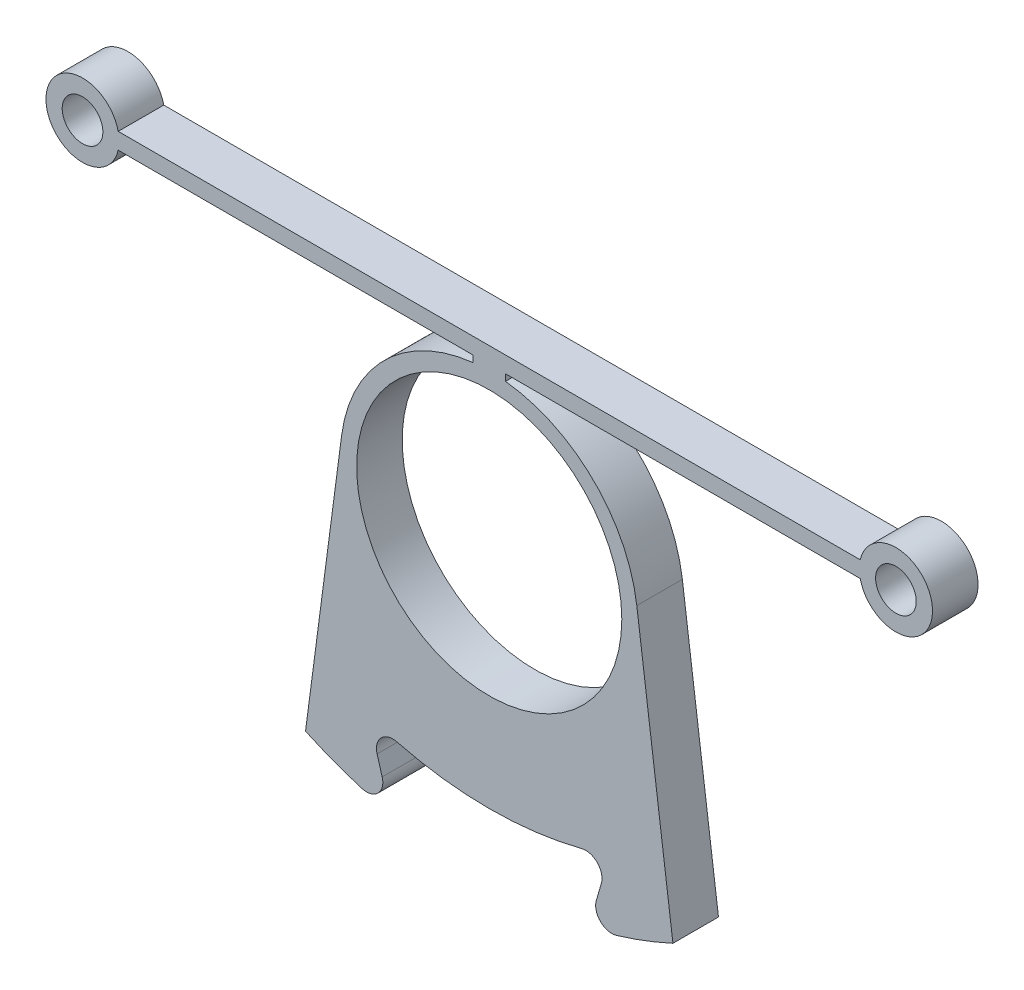
ISO-10303-21;
HEADER;
FILE_DESCRIPTION(('STEP AP214'),'2;1');
FILE_NAME('part.step','',(''),(''),'','','');
FILE_SCHEMA(('AUTOMOTIVE_DESIGN { 1 0 10303 214 1 1 1 1 }'));
ENDSEC;
DATA;
#1=APPLICATION_CONTEXT('core data for automotive mechanical design processes');
#2=APPLICATION_PROTOCOL_DEFINITION('international standard','automotive_design',2000,#1);
#3=PRODUCT_CONTEXT('',#1,'mechanical');
#4=PRODUCT('Part','Part','',(#3));
#5=PRODUCT_RELATED_PRODUCT_CATEGORY('part','',(#4));
#6=PRODUCT_DEFINITION_FORMATION('','',#4);
#7=PRODUCT_DEFINITION_CONTEXT('part definition',#1,'design');
#8=PRODUCT_DEFINITION('design','',#6,#7);
#9=PRODUCT_DEFINITION_SHAPE('','',#8);
#10=(LENGTH_UNIT() NAMED_UNIT(*) SI_UNIT(.MILLI.,.METRE.));
#11=(NAMED_UNIT(*) PLANE_ANGLE_UNIT() SI_UNIT($,.RADIAN.));
#12=(NAMED_UNIT(*) SI_UNIT($,.STERADIAN.) SOLID_ANGLE_UNIT());
#13=UNCERTAINTY_MEASURE_WITH_UNIT(LENGTH_MEASURE(1.E-05),#10,'distance_accuracy_value','');
#14=(GEOMETRIC_REPRESENTATION_CONTEXT(3) GLOBAL_UNCERTAINTY_ASSIGNED_CONTEXT((#13)) GLOBAL_UNIT_ASSIGNED_CONTEXT((#10,
#11,#12)) REPRESENTATION_CONTEXT('',''));
#15=CARTESIAN_POINT('',(0.,0.,0.));
#16=DIRECTION('',(0.,0.,1.));
#17=DIRECTION('',(1.,0.,0.));
#18=AXIS2_PLACEMENT_3D('',#15,#16,#17);
#19=CARTESIAN_POINT('',(0.,-5.,2.8));
#20=DIRECTION('',(0.,0.,-1.));
#21=DIRECTION('',(-1.,0.,0.));
#22=AXIS2_PLACEMENT_3D('',#19,#20,#21);
#23=CYLINDRICAL_SURFACE('',#22,9.15);
#24=CARTESIAN_POINT('',(0.,-5.,0.));
#25=DIRECTION('',(0.,0.,1.));
#26=DIRECTION('',(1.,0.,0.));
#27=AXIS2_PLACEMENT_3D('',#24,#25,#26);
#28=CIRCLE('',#27,9.15);
#29=CARTESIAN_POINT('',(9.07172048157037,-3.80568534118655,0.));
#30=VERTEX_POINT('',#29);
#31=CARTESIAN_POINT('',(1.,4.09519103702611,0.));
#32=VERTEX_POINT('',#31);
#33=EDGE_CURVE('E207',#30,#32,#28,.T.);
#34=ORIENTED_EDGE('',*,*,#33,.T.);
#35=DIRECTION('',(0.,0.,-1.));
#36=VECTOR('',#35,1.);
#37=CARTESIAN_POINT('',(1.,4.09519103702611,2.8));
#38=LINE('',#37,#36);
#39=CARTESIAN_POINT('',(1.,4.09519103702611,2.8));
#40=VERTEX_POINT('',#39);
#41=EDGE_CURVE('E186',#40,#32,#38,.T.);
#42=ORIENTED_EDGE('',*,*,#41,.F.);
#43=CARTESIAN_POINT('',(0.,-5.,2.8));
#44=DIRECTION('',(0.,0.,1.));
#45=DIRECTION('',(1.,0.,0.));
#46=AXIS2_PLACEMENT_3D('',#43,#44,#45);
#47=CIRCLE('',#46,9.15);
#48=CARTESIAN_POINT('',(9.07172048157037,-3.80568534118655,2.8));
#49=VERTEX_POINT('',#48);
#50=EDGE_CURVE('E192',#49,#40,#47,.T.);
#51=ORIENTED_EDGE('',*,*,#50,.F.);
#52=DIRECTION('',(0.,0.,-1.));
#53=VECTOR('',#52,1.);
#54=CARTESIAN_POINT('',(9.07172048157037,-3.80568534118655,2.8));
#55=LINE('',#54,#53);
#56=EDGE_CURVE('E284',#49,#30,#55,.T.);
#57=ORIENTED_EDGE('',*,*,#56,.T.);
#58=EDGE_LOOP('',(#34,#42,#51,#57));
#59=FACE_BOUND('',#58,.T.);
#60=ADVANCED_FACE('F45',(#59),#23,.T.);
#61=CARTESIAN_POINT('',(0.999999999999994,0.,2.8));
#62=DIRECTION('',(-1.,0.,0.));
#63=DIRECTION('',(0.,-1.,0.));
#64=AXIS2_PLACEMENT_3D('',#61,#62,#63);
#65=PLANE('',#64);
#66=DIRECTION('',(0.,1.,0.));
#67=VECTOR('',#66,1.);
#68=CARTESIAN_POINT('',(0.999999999999994,0.,0.));
#69=LINE('',#68,#67);
#70=CARTESIAN_POINT('',(1.,4.5,0.));
#71=VERTEX_POINT('',#70);
#72=EDGE_CURVE('E289',#32,#71,#69,.T.);
#73=ORIENTED_EDGE('',*,*,#72,.T.);
#74=DIRECTION('',(0.,0.,-1.));
#75=VECTOR('',#74,1.);
#76=CARTESIAN_POINT('',(1.,4.5,2.8));
#77=LINE('',#76,#75);
#78=CARTESIAN_POINT('',(1.,4.5,2.8));
#79=VERTEX_POINT('',#78);
#80=EDGE_CURVE('E189',#79,#71,#77,.T.);
#81=ORIENTED_EDGE('',*,*,#80,.F.);
#82=DIRECTION('',(0.,1.,0.));
#83=VECTOR('',#82,1.);
#84=CARTESIAN_POINT('',(0.999999999999994,0.,2.8));
#85=LINE('',#84,#83);
#86=EDGE_CURVE('E182',#40,#79,#85,.T.);
#87=ORIENTED_EDGE('',*,*,#86,.F.);
#88=ORIENTED_EDGE('',*,*,#41,.T.);
#89=EDGE_LOOP('',(#73,#81,#87,#88));
#90=FACE_BOUND('',#89,.T.);
#91=ADVANCED_FACE('F184',(#90),#65,.F.);
#92=CARTESIAN_POINT('',(0.,4.5,2.8));
#93=DIRECTION('',(0.,1.,0.));
#94=DIRECTION('',(-1.,0.,0.));
#95=AXIS2_PLACEMENT_3D('',#92,#93,#94);
#96=PLANE('',#95);
#97=DIRECTION('',(1.,0.,0.));
#98=VECTOR('',#97,1.);
#99=CARTESIAN_POINT('',(0.,4.5,0.));
#100=LINE('',#99,#98);
#101=CARTESIAN_POINT('',(22.806258903152,4.5,0.));
#102=VERTEX_POINT('',#101);
#103=EDGE_CURVE('E292',#71,#102,#100,.T.);
#104=ORIENTED_EDGE('',*,*,#103,.T.);
#105=DIRECTION('',(0.,0.,-1.));
#106=VECTOR('',#105,1.);
#107=CARTESIAN_POINT('',(22.806258903152,4.5,2.8));
#108=LINE('',#107,#106);
#109=CARTESIAN_POINT('',(22.806258903152,4.5,2.8));
#110=VERTEX_POINT('',#109);
#111=EDGE_CURVE('E213',#110,#102,#108,.T.);
#112=ORIENTED_EDGE('',*,*,#111,.F.);
#113=DIRECTION('',(1.,0.,0.));
#114=VECTOR('',#113,1.);
#115=CARTESIAN_POINT('',(0.,4.5,2.8));
#116=LINE('',#115,#114);
#117=EDGE_CURVE('E191',#79,#110,#116,.T.);
#118=ORIENTED_EDGE('',*,*,#117,.F.);
#119=ORIENTED_EDGE('',*,*,#80,.T.);
#120=EDGE_LOOP('',(#104,#112,#118,#119));
#121=FACE_BOUND('',#120,.T.);
#122=ADVANCED_FACE('F403',(#121),#96,.F.);
#123=CARTESIAN_POINT('',(25.,5.00000000000001,2.8));
#124=DIRECTION('',(0.,0.,-1.));
#125=DIRECTION('',(-1.,0.,0.));
#126=AXIS2_PLACEMENT_3D('',#123,#124,#125);
#127=CYLINDRICAL_SURFACE('',#126,2.25);
#128=CARTESIAN_POINT('',(25.,5.00000000000001,0.));
#129=DIRECTION('',(0.,0.,1.));
#130=DIRECTION('',(1.,0.,0.));
#131=AXIS2_PLACEMENT_3D('',#128,#129,#130);
#132=CIRCLE('',#131,2.25);
#133=CARTESIAN_POINT('',(22.806258903152,5.5,0.));
#134=VERTEX_POINT('',#133);
#135=EDGE_CURVE('E294',#102,#134,#132,.T.);
#136=ORIENTED_EDGE('',*,*,#135,.T.);
#137=DIRECTION('',(0.,0.,-1.));
#138=VECTOR('',#137,1.);
#139=CARTESIAN_POINT('',(22.806258903152,5.5,2.8));
#140=LINE('',#139,#138);
#141=CARTESIAN_POINT('',(22.806258903152,5.5,2.8));
#142=VERTEX_POINT('',#141);
#143=EDGE_CURVE('E342',#142,#134,#140,.T.);
#144=ORIENTED_EDGE('',*,*,#143,.F.);
#145=CARTESIAN_POINT('',(25.,5.00000000000001,2.8));
#146=DIRECTION('',(0.,0.,1.));
#147=DIRECTION('',(1.,0.,0.));
#148=AXIS2_PLACEMENT_3D('',#145,#146,#147);
#149=CIRCLE('',#148,2.25);
#150=EDGE_CURVE('E350',#110,#142,#149,.T.);
#151=ORIENTED_EDGE('',*,*,#150,.F.);
#152=ORIENTED_EDGE('',*,*,#111,.T.);
#153=EDGE_LOOP('',(#136,#144,#151,#152));
#154=FACE_BOUND('',#153,.T.);
#155=ADVANCED_FACE('F348',(#154),#127,.T.);
#156=CARTESIAN_POINT('',(0.,5.5,2.8));
#157=DIRECTION('',(0.,1.,0.));
#158=DIRECTION('',(-1.,0.,0.));
#159=AXIS2_PLACEMENT_3D('',#156,#157,#158);
#160=PLANE('',#159);
#161=DIRECTION('',(1.,0.,0.));
#162=VECTOR('',#161,1.);
#163=CARTESIAN_POINT('',(0.,5.5,0.));
#164=LINE('',#163,#162);
#165=CARTESIAN_POINT('',(-22.806258903152,5.5,0.));
#166=VERTEX_POINT('',#165);
#167=EDGE_CURVE('E298',#166,#134,#164,.T.);
#168=ORIENTED_EDGE('',*,*,#167,.F.);
#169=DIRECTION('',(0.,0.,-1.));
#170=VECTOR('',#169,1.);
#171=CARTESIAN_POINT('',(-22.806258903152,5.5,2.8));
#172=LINE('',#171,#170);
#173=CARTESIAN_POINT('',(-22.806258903152,5.5,2.8));
#174=VERTEX_POINT('',#173);
#175=EDGE_CURVE('E340',#174,#166,#172,.T.);
#176=ORIENTED_EDGE('',*,*,#175,.F.);
#177=DIRECTION('',(1.,0.,0.));
#178=VECTOR('',#177,1.);
#179=CARTESIAN_POINT('',(0.,5.5,2.8));
#180=LINE('',#179,#178);
#181=EDGE_CURVE('E361',#174,#142,#180,.T.);
#182=ORIENTED_EDGE('',*,*,#181,.T.);
#183=ORIENTED_EDGE('',*,*,#143,.T.);
#184=EDGE_LOOP('',(#168,#176,#182,#183));
#185=FACE_BOUND('',#184,.T.);
#186=ADVANCED_FACE('F357',(#185),#160,.T.);
#187=CARTESIAN_POINT('',(-25.,5.,2.8));
#188=DIRECTION('',(0.,0.,-1.));
#189=DIRECTION('',(-1.,0.,0.));
#190=AXIS2_PLACEMENT_3D('',#187,#188,#189);
#191=CYLINDRICAL_SURFACE('',#190,2.25);
#192=CARTESIAN_POINT('',(-25.,5.,0.));
#193=DIRECTION('',(0.,0.,1.));
#194=DIRECTION('',(1.,0.,0.));
#195=AXIS2_PLACEMENT_3D('',#192,#193,#194);
#196=CIRCLE('',#195,2.25);
#197=CARTESIAN_POINT('',(-22.806258903152,4.5,0.));
#198=VERTEX_POINT('',#197);
#199=EDGE_CURVE('E301',#166,#198,#196,.T.);
#200=ORIENTED_EDGE('',*,*,#199,.T.);
#201=DIRECTION('',(0.,0.,-1.));
#202=VECTOR('',#201,1.);
#203=CARTESIAN_POINT('',(-22.806258903152,4.5,2.8));
#204=LINE('',#203,#202);
#205=CARTESIAN_POINT('',(-22.806258903152,4.5,2.8));
#206=VERTEX_POINT('',#205);
#207=EDGE_CURVE('E337',#206,#198,#204,.T.);
#208=ORIENTED_EDGE('',*,*,#207,.F.);
#209=CARTESIAN_POINT('',(-25.,5.,2.8));
#210=DIRECTION('',(0.,0.,1.));
#211=DIRECTION('',(1.,0.,0.));
#212=AXIS2_PLACEMENT_3D('',#209,#210,#211);
#213=CIRCLE('',#212,2.25);
#214=EDGE_CURVE('E362',#174,#206,#213,.T.);
#215=ORIENTED_EDGE('',*,*,#214,.F.);
#216=ORIENTED_EDGE('',*,*,#175,.T.);
#217=EDGE_LOOP('',(#200,#208,#215,#216));
#218=FACE_BOUND('',#217,.T.);
#219=ADVANCED_FACE('F402',(#218),#191,.T.);
#220=CARTESIAN_POINT('',(-1.,4.5,0.));
#221=VERTEX_POINT('',#220);
#222=EDGE_CURVE('E295',#198,#221,#100,.T.);
#223=ORIENTED_EDGE('',*,*,#222,.T.);
#224=DIRECTION('',(0.,0.,-1.));
#225=VECTOR('',#224,1.);
#226=CARTESIAN_POINT('',(-1.,4.5,2.8));
#227=LINE('',#226,#225);
#228=CARTESIAN_POINT('',(-1.,4.5,2.8));
#229=VERTEX_POINT('',#228);
#230=EDGE_CURVE('E335',#229,#221,#227,.T.);
#231=ORIENTED_EDGE('',*,*,#230,.F.);
#232=EDGE_CURVE('E364',#206,#229,#116,.T.);
#233=ORIENTED_EDGE('',*,*,#232,.F.);
#234=ORIENTED_EDGE('',*,*,#207,.T.);
#235=EDGE_LOOP('',(#223,#231,#233,#234));
#236=FACE_BOUND('',#235,.T.);
#237=ADVANCED_FACE('F399',(#236),#96,.F.);
#238=CARTESIAN_POINT('',(-0.999999999999994,0.,2.8));
#239=DIRECTION('',(-1.,0.,0.));
#240=DIRECTION('',(0.,-1.,0.));
#241=AXIS2_PLACEMENT_3D('',#238,#239,#240);
#242=PLANE('',#241);
#243=DIRECTION('',(0.,1.,0.));
#244=VECTOR('',#243,1.);
#245=CARTESIAN_POINT('',(-0.999999999999994,0.,0.));
#246=LINE('',#245,#244);
#247=CARTESIAN_POINT('',(-1.,4.09519103702611,0.));
#248=VERTEX_POINT('',#247);
#249=EDGE_CURVE('E303',#248,#221,#246,.T.);
#250=ORIENTED_EDGE('',*,*,#249,.F.);
#251=DIRECTION('',(0.,0.,-1.));
#252=VECTOR('',#251,1.);
#253=CARTESIAN_POINT('',(-1.,4.09519103702611,2.8));
#254=LINE('',#253,#252);
#255=CARTESIAN_POINT('',(-1.,4.09519103702611,2.8));
#256=VERTEX_POINT('',#255);
#257=EDGE_CURVE('E333',#256,#248,#254,.T.);
#258=ORIENTED_EDGE('',*,*,#257,.F.);
#259=DIRECTION('',(0.,1.,0.));
#260=VECTOR('',#259,1.);
#261=CARTESIAN_POINT('',(-0.999999999999994,0.,2.8));
#262=LINE('',#261,#260);
#263=EDGE_CURVE('E369',#256,#229,#262,.T.);
#264=ORIENTED_EDGE('',*,*,#263,.T.);
#265=ORIENTED_EDGE('',*,*,#230,.T.);
#266=EDGE_LOOP('',(#250,#258,#264,#265));
#267=FACE_BOUND('',#266,.T.);
#268=ADVANCED_FACE('F392',(#267),#242,.T.);
#269=CARTESIAN_POINT('',(-9.07172048157037,-3.80568534118656,0.));
#270=VERTEX_POINT('',#269);
#271=EDGE_CURVE('E290',#248,#270,#28,.T.);
#272=ORIENTED_EDGE('',*,*,#271,.T.);
#273=DIRECTION('',(0.,0.,-1.));
#274=VECTOR('',#273,1.);
#275=CARTESIAN_POINT('',(-9.07172048157037,-3.80568534118656,2.8));
#276=LINE('',#275,#274);
#277=CARTESIAN_POINT('',(-9.07172048157037,-3.80568534118656,2.8));
#278=VERTEX_POINT('',#277);
#279=EDGE_CURVE('E331',#278,#270,#276,.T.);
#280=ORIENTED_EDGE('',*,*,#279,.F.);
#281=EDGE_CURVE('E205',#256,#278,#47,.T.);
#282=ORIENTED_EDGE('',*,*,#281,.F.);
#283=ORIENTED_EDGE('',*,*,#257,.T.);
#284=EDGE_LOOP('',(#272,#280,#282,#283));
#285=FACE_BOUND('',#284,.T.);
#286=ADVANCED_FACE('F418',(#285),#23,.T.);
#287=CARTESIAN_POINT('',(-8.42467286881409,1.10912922453611,2.8));
#288=DIRECTION('',(-0.991444861373811,0.130526192220048,0.));
#289=DIRECTION('',(-0.130526192220048,-0.991444861373811,0.));
#290=AXIS2_PLACEMENT_3D('',#287,#288,#289);
#291=PLANE('',#290);
#292=DIRECTION('',(0.130526192220048,0.991444861373811,0.));
#293=VECTOR('',#292,1.);
#294=CARTESIAN_POINT('',(-8.42467286881409,1.10912922453611,0.));
#295=LINE('',#294,#293);
#296=CARTESIAN_POINT('',(-11.2926113864992,-20.6750265662141,0.));
#297=VERTEX_POINT('',#296);
#298=EDGE_CURVE('E306',#297,#270,#295,.T.);
#299=ORIENTED_EDGE('',*,*,#298,.F.);
#300=DIRECTION('',(0.,0.,-1.));
#301=VECTOR('',#300,1.);
#302=CARTESIAN_POINT('',(-11.2926113864992,-20.6750265662141,2.8));
#303=LINE('',#302,#301);
#304=CARTESIAN_POINT('',(-11.2926113864992,-20.6750265662141,2.8));
#305=VERTEX_POINT('',#304);
#306=EDGE_CURVE('E329',#305,#297,#303,.T.);
#307=ORIENTED_EDGE('',*,*,#306,.F.);
#308=DIRECTION('',(0.130526192220048,0.991444861373811,0.));
#309=VECTOR('',#308,1.);
#310=CARTESIAN_POINT('',(-8.42467286881409,1.10912922453611,2.8));
#311=LINE('',#310,#309);
#312=EDGE_CURVE('E372',#305,#278,#311,.T.);
#313=ORIENTED_EDGE('',*,*,#312,.T.);
#314=ORIENTED_EDGE('',*,*,#279,.T.);
#315=EDGE_LOOP('',(#299,#307,#313,#314));
#316=FACE_BOUND('',#315,.T.);
#317=ADVANCED_FACE('F385',(#316),#291,.T.);
#318=CARTESIAN_POINT('',(0.,3.84999999999999,2.8));
#319=DIRECTION('',(0.,0.,-1.));
#320=DIRECTION('',(-1.,0.,0.));
#321=AXIS2_PLACEMENT_3D('',#318,#319,#320);
#322=CYLINDRICAL_SURFACE('',#321,27.);
#323=CARTESIAN_POINT('',(0.,3.84999999999999,0.));
#324=DIRECTION('',(0.,0.,1.));
#325=DIRECTION('',(1.,0.,0.));
#326=AXIS2_PLACEMENT_3D('',#323,#324,#325);
#327=CIRCLE('',#326,27.);
#328=CARTESIAN_POINT('',(-7.83190085999727,-21.9891433472392,0.));
#329=VERTEX_POINT('',#328);
#330=EDGE_CURVE('E259',#297,#329,#327,.T.);
#331=ORIENTED_EDGE('',*,*,#330,.T.);
#332=DIRECTION('',(0.,0.,-1.));
#333=VECTOR('',#332,1.);
#334=CARTESIAN_POINT('',(-7.83190085999727,-21.9891433472392,2.8));
#335=LINE('',#334,#333);
#336=CARTESIAN_POINT('',(-7.83190085999727,-21.9891433472392,2.8));
#337=VERTEX_POINT('',#336);
#338=EDGE_CURVE('E238',#329,#337,#335,.F.);
#339=ORIENTED_EDGE('',*,*,#338,.T.);
#340=CARTESIAN_POINT('',(0.,3.84999999999999,2.8));
#341=DIRECTION('',(0.,0.,1.));
#342=DIRECTION('',(1.,0.,0.));
#343=AXIS2_PLACEMENT_3D('',#340,#341,#342);
#344=CIRCLE('',#343,27.);
#345=EDGE_CURVE('E271',#305,#337,#344,.T.);
#346=ORIENTED_EDGE('',*,*,#345,.F.);
#347=ORIENTED_EDGE('',*,*,#306,.T.);
#348=EDGE_LOOP('',(#331,#339,#346,#347));
#349=FACE_BOUND('',#348,.T.);
#350=ADVANCED_FACE('F383',(#349),#322,.T.);
#351=CARTESIAN_POINT('',(-11.6199426899342,-3.36748749271654,2.8));
#352=DIRECTION('',(-0.960479887724279,-0.278349394246075,0.));
#353=DIRECTION('',(0.278349394246075,-0.960479887724279,0.));
#354=AXIS2_PLACEMENT_3D('',#351,#352,#353);
#355=PLANE('',#354);
#356=DIRECTION('',(-0.278349394246075,0.960479887724279,0.));
#357=VECTOR('',#356,1.);
#358=CARTESIAN_POINT('',(-11.6199426899342,-3.36748749271654,0.));
#359=LINE('',#358,#357);
#360=CARTESIAN_POINT('',(-6.58135057005087,-20.7537886438361,0.));
#361=VERTEX_POINT('',#360);
#362=CARTESIAN_POINT('',(-6.89138353352823,-19.6839805820722,0.));
#363=VERTEX_POINT('',#362);
#364=EDGE_CURVE('E250',#361,#363,#359,.T.);
#365=ORIENTED_EDGE('',*,*,#364,.T.);
#366=DIRECTION('',(0.,0.,1.));
#367=VECTOR('',#366,1.);
#368=CARTESIAN_POINT('',(-6.89138353352823,-19.6839805820722,2.8));
#369=LINE('',#368,#367);
#370=CARTESIAN_POINT('',(-6.89138353352823,-19.6839805820722,2.8));
#371=VERTEX_POINT('',#370);
#372=EDGE_CURVE('E236',#363,#371,#369,.T.);
#373=ORIENTED_EDGE('',*,*,#372,.T.);
#374=DIRECTION('',(-0.278349394246075,0.960479887724279,0.));
#375=VECTOR('',#374,1.);
#376=CARTESIAN_POINT('',(-11.6199426899342,-3.36748749271654,2.8));
#377=LINE('',#376,#375);
#378=CARTESIAN_POINT('',(-6.58135057005087,-20.7537886438361,2.8));
#379=VERTEX_POINT('',#378);
#380=EDGE_CURVE('E266',#379,#371,#377,.T.);
#381=ORIENTED_EDGE('',*,*,#380,.F.);
#382=DIRECTION('',(0.,0.,-1.));
#383=VECTOR('',#382,1.);
#384=CARTESIAN_POINT('',(-6.58135057005087,-20.7537886438361,2.8));
#385=LINE('',#384,#383);
#386=EDGE_CURVE('E233',#379,#361,#385,.T.);
#387=ORIENTED_EDGE('',*,*,#386,.T.);
#388=EDGE_LOOP('',(#365,#373,#381,#387));
#389=FACE_BOUND('',#388,.T.);
#390=ADVANCED_FACE('F256',(#389),#355,.F.);
#391=CARTESIAN_POINT('',(0.,3.84999999999999,2.8));
#392=DIRECTION('',(0.,0.,-1.));
#393=DIRECTION('',(-1.,0.,0.));
#394=AXIS2_PLACEMENT_3D('',#391,#392,#393);
#395=CYLINDRICAL_SURFACE('',#394,23.);
#396=CARTESIAN_POINT('',(0.,3.84999999999999,0.));
#397=DIRECTION('',(0.,0.,1.));
#398=DIRECTION('',(1.,0.,0.));
#399=AXIS2_PLACEMENT_3D('',#396,#397,#398);
#400=CIRCLE('',#399,23.);
#401=CARTESIAN_POINT('',(-5.68378266056212,-18.436646555,0.));
#402=VERTEX_POINT('',#401);
#403=CARTESIAN_POINT('',(5.68378266056213,-18.436646555,0.));
#404=VERTEX_POINT('',#403);
#405=EDGE_CURVE('E251',#402,#404,#400,.T.);
#406=ORIENTED_EDGE('',*,*,#405,.T.);
#407=DIRECTION('',(0.,0.,-1.));
#408=VECTOR('',#407,1.);
#409=CARTESIAN_POINT('',(5.68378266056213,-18.436646555,2.8));
#410=LINE('',#409,#408);
#411=CARTESIAN_POINT('',(5.68378266056213,-18.436646555,2.8));
#412=VERTEX_POINT('',#411);
#413=EDGE_CURVE('E60',#404,#412,#410,.F.);
#414=ORIENTED_EDGE('',*,*,#413,.T.);
#415=CARTESIAN_POINT('',(0.,3.84999999999999,2.8));
#416=DIRECTION('',(0.,0.,1.));
#417=DIRECTION('',(1.,0.,0.));
#418=AXIS2_PLACEMENT_3D('',#415,#416,#417);
#419=CIRCLE('',#418,23.);
#420=CARTESIAN_POINT('',(-5.68378266056212,-18.436646555,2.8));
#421=VERTEX_POINT('',#420);
#422=EDGE_CURVE('E263',#421,#412,#419,.T.);
#423=ORIENTED_EDGE('',*,*,#422,.F.);
#424=DIRECTION('',(0.,0.,-1.));
#425=VECTOR('',#424,1.);
#426=CARTESIAN_POINT('',(-5.68378266056212,-18.436646555,2.8));
#427=LINE('',#426,#425);
#428=EDGE_CURVE('E229',#421,#402,#427,.T.);
#429=ORIENTED_EDGE('',*,*,#428,.T.);
#430=EDGE_LOOP('',(#406,#414,#423,#429));
#431=FACE_BOUND('',#430,.T.);
#432=ADVANCED_FACE('F262',(#431),#395,.T.);
#433=CARTESIAN_POINT('',(11.6199426899342,-3.36748749271653,2.8));
#434=DIRECTION('',(-0.960479887724279,0.278349394246075,0.));
#435=DIRECTION('',(-0.278349394246075,-0.960479887724279,0.));
#436=AXIS2_PLACEMENT_3D('',#433,#434,#435);
#437=PLANE('',#436);
#438=DIRECTION('',(0.278349394246075,0.960479887724279,0.));
#439=VECTOR('',#438,1.);
#440=CARTESIAN_POINT('',(11.6199426899342,-3.36748749271653,0.));
#441=LINE('',#440,#439);
#442=CARTESIAN_POINT('',(6.58135057005088,-20.7537886438361,0.));
#443=VERTEX_POINT('',#442);
#444=CARTESIAN_POINT('',(6.89138353352823,-19.6839805820722,0.));
#445=VERTEX_POINT('',#444);
#446=EDGE_CURVE('E312',#443,#445,#441,.T.);
#447=ORIENTED_EDGE('',*,*,#446,.F.);
#448=DIRECTION('',(0.,0.,-1.));
#449=VECTOR('',#448,1.);
#450=CARTESIAN_POINT('',(6.58135057005088,-20.7537886438361,2.8));
#451=LINE('',#450,#449);
#452=CARTESIAN_POINT('',(6.58135057005088,-20.7537886438361,2.8));
#453=VERTEX_POINT('',#452);
#454=EDGE_CURVE('E223',#443,#453,#451,.F.);
#455=ORIENTED_EDGE('',*,*,#454,.T.);
#456=DIRECTION('',(0.278349394246075,0.960479887724279,0.));
#457=VECTOR('',#456,1.);
#458=CARTESIAN_POINT('',(11.6199426899342,-3.36748749271653,2.8));
#459=LINE('',#458,#457);
#460=CARTESIAN_POINT('',(6.89138353352823,-19.6839805820722,2.8));
#461=VERTEX_POINT('',#460);
#462=EDGE_CURVE('E265',#453,#461,#459,.T.);
#463=ORIENTED_EDGE('',*,*,#462,.T.);
#464=DIRECTION('',(0.,0.,-1.));
#465=VECTOR('',#464,1.);
#466=CARTESIAN_POINT('',(6.89138353352824,-19.6839805820722,2.8));
#467=LINE('',#466,#465);
#468=EDGE_CURVE('E220',#461,#445,#467,.T.);
#469=ORIENTED_EDGE('',*,*,#468,.T.);
#470=EDGE_LOOP('',(#447,#455,#463,#469));
#471=FACE_BOUND('',#470,.T.);
#472=ADVANCED_FACE('F497',(#471),#437,.T.);
#473=CARTESIAN_POINT('',(0.,3.84999999999999,2.8));
#474=DIRECTION('',(0.,0.,-1.));
#475=DIRECTION('',(-1.,0.,0.));
#476=AXIS2_PLACEMENT_3D('',#473,#474,#475);
#477=CYLINDRICAL_SURFACE('',#476,27.);
#478=CARTESIAN_POINT('',(0.,3.84999999999999,2.8));
#479=DIRECTION('',(0.,0.,1.));
#480=DIRECTION('',(1.,0.,0.));
#481=AXIS2_PLACEMENT_3D('',#478,#479,#480);
#482=CIRCLE('',#481,27.);
#483=CARTESIAN_POINT('',(11.2926113864992,-20.6750265662141,2.8));
#484=VERTEX_POINT('',#483);
#485=CARTESIAN_POINT('',(7.83190085999728,-21.9891433472392,2.8));
#486=VERTEX_POINT('',#485);
#487=EDGE_CURVE('E269',#484,#486,#482,.F.);
#488=ORIENTED_EDGE('',*,*,#487,.T.);
#489=DIRECTION('',(0.,0.,-1.));
#490=VECTOR('',#489,1.);
#491=CARTESIAN_POINT('',(7.83190085999728,-21.9891433472392,2.8));
#492=LINE('',#491,#490);
#493=CARTESIAN_POINT('',(7.83190085999728,-21.9891433472392,0.));
#494=VERTEX_POINT('',#493);
#495=EDGE_CURVE('E208',#486,#494,#492,.T.);
#496=ORIENTED_EDGE('',*,*,#495,.T.);
#497=CARTESIAN_POINT('',(0.,3.84999999999999,0.));
#498=DIRECTION('',(0.,0.,1.));
#499=DIRECTION('',(1.,0.,0.));
#500=AXIS2_PLACEMENT_3D('',#497,#498,#499);
#501=CIRCLE('',#500,27.);
#502=CARTESIAN_POINT('',(11.2926113864992,-20.6750265662141,0.));
#503=VERTEX_POINT('',#502);
#504=EDGE_CURVE('E315',#503,#494,#501,.F.);
#505=ORIENTED_EDGE('',*,*,#504,.F.);
#506=DIRECTION('',(0.,0.,-1.));
#507=VECTOR('',#506,1.);
#508=CARTESIAN_POINT('',(11.2926113864992,-20.6750265662141,2.8));
#509=LINE('',#508,#507);
#510=EDGE_CURVE('E327',#484,#503,#509,.T.);
#511=ORIENTED_EDGE('',*,*,#510,.F.);
#512=EDGE_LOOP('',(#488,#496,#505,#511));
#513=FACE_BOUND('',#512,.T.);
#514=ADVANCED_FACE('F504',(#513),#477,.T.);
#515=CARTESIAN_POINT('',(-25.,5.,2.8));
#516=DIRECTION('',(0.,0.,-1.));
#517=DIRECTION('',(-1.,0.,0.));
#518=AXIS2_PLACEMENT_3D('',#515,#516,#517);
#519=CYLINDRICAL_SURFACE('',#518,1.25);
#520=CARTESIAN_POINT('',(-25.,5.,2.8));
#521=DIRECTION('',(0.,0.,1.));
#522=DIRECTION('',(1.,0.,0.));
#523=AXIS2_PLACEMENT_3D('',#520,#521,#522);
#524=CIRCLE('',#523,1.25);
#525=CARTESIAN_POINT('',(-23.75,5.,2.8));
#526=VERTEX_POINT('',#525);
#527=EDGE_CURVE('E278',#526,#526,#524,.T.);
#528=ORIENTED_EDGE('',*,*,#527,.T.);
#529=EDGE_LOOP('',(#528));
#530=FACE_BOUND('',#529,.T.);
#531=CARTESIAN_POINT('',(-25.,5.,0.));
#532=DIRECTION('',(0.,0.,1.));
#533=DIRECTION('',(1.,0.,0.));
#534=AXIS2_PLACEMENT_3D('',#531,#532,#533);
#535=CIRCLE('',#534,1.25);
#536=CARTESIAN_POINT('',(-23.75,5.,0.));
#537=VERTEX_POINT('',#536);
#538=EDGE_CURVE('E320',#537,#537,#535,.T.);
#539=ORIENTED_EDGE('',*,*,#538,.F.);
#540=EDGE_LOOP('',(#539));
#541=FACE_BOUND('',#540,.T.);
#542=ADVANCED_FACE('F512',(#530,#541),#519,.F.);
#543=CARTESIAN_POINT('',(8.42467286881408,1.10912922453612,2.8));
#544=DIRECTION('',(0.991444861373811,0.130526192220049,0.));
#545=DIRECTION('',(-0.130526192220049,0.991444861373811,0.));
#546=AXIS2_PLACEMENT_3D('',#543,#544,#545);
#547=PLANE('',#546);
#548=DIRECTION('',(0.130526192220049,-0.991444861373811,0.));
#549=VECTOR('',#548,1.);
#550=CARTESIAN_POINT('',(8.42467286881408,1.10912922453612,0.));
#551=LINE('',#550,#549);
#552=EDGE_CURVE('E317',#30,#503,#551,.T.);
#553=ORIENTED_EDGE('',*,*,#552,.F.);
#554=ORIENTED_EDGE('',*,*,#56,.F.);
#555=DIRECTION('',(0.130526192220049,-0.991444861373811,0.));
#556=VECTOR('',#555,1.);
#557=CARTESIAN_POINT('',(8.42467286881408,1.10912922453612,2.8));
#558=LINE('',#557,#556);
#559=EDGE_CURVE('E201',#49,#484,#558,.T.);
#560=ORIENTED_EDGE('',*,*,#559,.T.);
#561=ORIENTED_EDGE('',*,*,#510,.T.);
#562=EDGE_LOOP('',(#553,#554,#560,#561));
#563=FACE_BOUND('',#562,.T.);
#564=ADVANCED_FACE('F520',(#563),#547,.T.);
#565=CARTESIAN_POINT('',(0.,-5.,2.8));
#566=DIRECTION('',(0.,0.,-1.));
#567=DIRECTION('',(-1.,0.,0.));
#568=AXIS2_PLACEMENT_3D('',#565,#566,#567);
#569=CYLINDRICAL_SURFACE('',#568,8.15);
#570=CARTESIAN_POINT('',(0.,-5.,2.8));
#571=DIRECTION('',(0.,0.,1.));
#572=DIRECTION('',(1.,0.,0.));
#573=AXIS2_PLACEMENT_3D('',#570,#571,#572);
#574=CIRCLE('',#573,8.15);
#575=CARTESIAN_POINT('',(8.15,-5.,2.8));
#576=VERTEX_POINT('',#575);
#577=EDGE_CURVE('E203',#576,#576,#574,.T.);
#578=ORIENTED_EDGE('',*,*,#577,.T.);
#579=EDGE_LOOP('',(#578));
#580=FACE_BOUND('',#579,.T.);
#581=CARTESIAN_POINT('',(0.,-5.,0.));
#582=DIRECTION('',(0.,0.,1.));
#583=DIRECTION('',(1.,0.,0.));
#584=AXIS2_PLACEMENT_3D('',#581,#582,#583);
#585=CIRCLE('',#584,8.15);
#586=CARTESIAN_POINT('',(8.15,-5.,0.));
#587=VERTEX_POINT('',#586);
#588=EDGE_CURVE('E285',#587,#587,#585,.T.);
#589=ORIENTED_EDGE('',*,*,#588,.F.);
#590=EDGE_LOOP('',(#589));
#591=FACE_BOUND('',#590,.T.);
#592=ADVANCED_FACE('F528',(#580,#591),#569,.F.);
#593=CARTESIAN_POINT('',(25.,5.00000000000001,2.8));
#594=DIRECTION('',(0.,0.,-1.));
#595=DIRECTION('',(-1.,0.,0.));
#596=AXIS2_PLACEMENT_3D('',#593,#594,#595);
#597=CYLINDRICAL_SURFACE('',#596,1.25);
#598=CARTESIAN_POINT('',(25.,5.00000000000001,2.8));
#599=DIRECTION('',(0.,0.,1.));
#600=DIRECTION('',(1.,0.,0.));
#601=AXIS2_PLACEMENT_3D('',#598,#599,#600);
#602=CIRCLE('',#601,1.25);
#603=CARTESIAN_POINT('',(26.25,5.00000000000001,2.8));
#604=VERTEX_POINT('',#603);
#605=EDGE_CURVE('E281',#604,#604,#602,.T.);
#606=ORIENTED_EDGE('',*,*,#605,.T.);
#607=EDGE_LOOP('',(#606));
#608=FACE_BOUND('',#607,.T.);
#609=CARTESIAN_POINT('',(25.,5.00000000000001,0.));
#610=DIRECTION('',(0.,0.,1.));
#611=DIRECTION('',(1.,0.,0.));
#612=AXIS2_PLACEMENT_3D('',#609,#610,#611);
#613=CIRCLE('',#612,1.25);
#614=CARTESIAN_POINT('',(26.25,5.00000000000001,0.));
#615=VERTEX_POINT('',#614);
#616=EDGE_CURVE('E323',#615,#615,#613,.T.);
#617=ORIENTED_EDGE('',*,*,#616,.F.);
#618=EDGE_LOOP('',(#617));
#619=FACE_BOUND('',#618,.T.);
#620=ADVANCED_FACE('F536',(#608,#619),#597,.F.);
#621=CARTESIAN_POINT('',(0.,0.,2.8));
#622=DIRECTION('',(0.,0.,1.));
#623=DIRECTION('',(1.,0.,0.));
#624=AXIS2_PLACEMENT_3D('',#621,#622,#623);
#625=PLANE('',#624);
#626=ORIENTED_EDGE('',*,*,#577,.F.);
#627=EDGE_LOOP('',(#626));
#628=FACE_BOUND('',#627,.T.);
#629=ORIENTED_EDGE('',*,*,#462,.F.);
#630=CARTESIAN_POINT('',(7.54183045777516,-21.0321380380822,2.8));
#631=DIRECTION('',(0.,0.,1.));
#632=DIRECTION('',(1.,0.,0.));
#633=AXIS2_PLACEMENT_3D('',#630,#631,#632);
#634=CIRCLE('',#633,1.);
#635=EDGE_CURVE('E227',#453,#486,#634,.T.);
#636=ORIENTED_EDGE('',*,*,#635,.T.);
#637=ORIENTED_EDGE('',*,*,#487,.F.);
#638=ORIENTED_EDGE('',*,*,#559,.F.);
#639=ORIENTED_EDGE('',*,*,#50,.T.);
#640=ORIENTED_EDGE('',*,*,#86,.T.);
#641=ORIENTED_EDGE('',*,*,#117,.T.);
#642=ORIENTED_EDGE('',*,*,#150,.T.);
#643=ORIENTED_EDGE('',*,*,#181,.F.);
#644=ORIENTED_EDGE('',*,*,#214,.T.);
#645=ORIENTED_EDGE('',*,*,#232,.T.);
#646=ORIENTED_EDGE('',*,*,#263,.F.);
#647=ORIENTED_EDGE('',*,*,#281,.T.);
#648=ORIENTED_EDGE('',*,*,#312,.F.);
#649=ORIENTED_EDGE('',*,*,#345,.T.);
#650=CARTESIAN_POINT('',(-7.54183045777515,-21.0321380380822,2.8));
#651=DIRECTION('',(0.,0.,1.));
#652=DIRECTION('',(1.,0.,0.));
#653=AXIS2_PLACEMENT_3D('',#650,#651,#652);
#654=CIRCLE('',#653,1.);
#655=EDGE_CURVE('E225',#337,#379,#654,.T.);
#656=ORIENTED_EDGE('',*,*,#655,.T.);
#657=ORIENTED_EDGE('',*,*,#380,.T.);
#658=CARTESIAN_POINT('',(-5.93090364580395,-19.4056311878261,2.8));
#659=DIRECTION('',(0.,0.,1.));
#660=DIRECTION('',(1.,0.,0.));
#661=AXIS2_PLACEMENT_3D('',#658,#659,#660);
#662=CIRCLE('',#661,1.);
#663=EDGE_CURVE('E11',#371,#421,#662,.F.);
#664=ORIENTED_EDGE('',*,*,#663,.T.);
#665=ORIENTED_EDGE('',*,*,#422,.T.);
#666=CARTESIAN_POINT('',(5.93090364580396,-19.4056311878261,2.8));
#667=DIRECTION('',(0.,0.,1.));
#668=DIRECTION('',(1.,0.,0.));
#669=AXIS2_PLACEMENT_3D('',#666,#667,#668);
#670=CIRCLE('',#669,1.);
#671=EDGE_CURVE('E242',#412,#461,#670,.F.);
#672=ORIENTED_EDGE('',*,*,#671,.T.);
#673=EDGE_LOOP('',(#629,#636,#637,#638,#639,#640,#641,#642,#643,#644,#645,#646,#647,#648,#649,
#656,#657,#664,#665,#672));
#674=FACE_BOUND('',#673,.T.);
#675=ORIENTED_EDGE('',*,*,#527,.F.);
#676=EDGE_LOOP('',(#675));
#677=FACE_BOUND('',#676,.T.);
#678=ORIENTED_EDGE('',*,*,#605,.F.);
#679=EDGE_LOOP('',(#678));
#680=FACE_BOUND('',#679,.T.);
#681=ADVANCED_FACE('F197',(#628,#674,#677,#680),#625,.T.);
#682=CARTESIAN_POINT('',(0.,0.,0.));
#683=DIRECTION('',(0.,0.,1.));
#684=DIRECTION('',(1.,0.,0.));
#685=AXIS2_PLACEMENT_3D('',#682,#683,#684);
#686=PLANE('',#685);
#687=ORIENTED_EDGE('',*,*,#588,.T.);
#688=EDGE_LOOP('',(#687));
#689=FACE_BOUND('',#688,.T.);
#690=ORIENTED_EDGE('',*,*,#504,.T.);
#691=CARTESIAN_POINT('',(7.54183045777516,-21.0321380380822,0.));
#692=DIRECTION('',(0.,0.,1.));
#693=DIRECTION('',(1.,0.,0.));
#694=AXIS2_PLACEMENT_3D('',#691,#692,#693);
#695=CIRCLE('',#694,1.);
#696=EDGE_CURVE('E218',#494,#443,#695,.F.);
#697=ORIENTED_EDGE('',*,*,#696,.T.);
#698=ORIENTED_EDGE('',*,*,#446,.T.);
#699=CARTESIAN_POINT('',(5.93090364580396,-19.4056311878261,0.));
#700=DIRECTION('',(0.,0.,1.));
#701=DIRECTION('',(1.,0.,0.));
#702=AXIS2_PLACEMENT_3D('',#699,#700,#701);
#703=CIRCLE('',#702,1.);
#704=EDGE_CURVE('E240',#445,#404,#703,.T.);
#705=ORIENTED_EDGE('',*,*,#704,.T.);
#706=ORIENTED_EDGE('',*,*,#405,.F.);
#707=CARTESIAN_POINT('',(-5.93090364580395,-19.4056311878261,0.));
#708=DIRECTION('',(0.,0.,1.));
#709=DIRECTION('',(1.,0.,0.));
#710=AXIS2_PLACEMENT_3D('',#707,#708,#709);
#711=CIRCLE('',#710,1.);
#712=EDGE_CURVE('E53',#402,#363,#711,.T.);
#713=ORIENTED_EDGE('',*,*,#712,.T.);
#714=ORIENTED_EDGE('',*,*,#364,.F.);
#715=CARTESIAN_POINT('',(-7.54183045777515,-21.0321380380822,0.));
#716=DIRECTION('',(0.,0.,1.));
#717=DIRECTION('',(1.,0.,0.));
#718=AXIS2_PLACEMENT_3D('',#715,#716,#717);
#719=CIRCLE('',#718,1.);
#720=EDGE_CURVE('E211',#361,#329,#719,.F.);
#721=ORIENTED_EDGE('',*,*,#720,.T.);
#722=ORIENTED_EDGE('',*,*,#330,.F.);
#723=ORIENTED_EDGE('',*,*,#298,.T.);
#724=ORIENTED_EDGE('',*,*,#271,.F.);
#725=ORIENTED_EDGE('',*,*,#249,.T.);
#726=ORIENTED_EDGE('',*,*,#222,.F.);
#727=ORIENTED_EDGE('',*,*,#199,.F.);
#728=ORIENTED_EDGE('',*,*,#167,.T.);
#729=ORIENTED_EDGE('',*,*,#135,.F.);
#730=ORIENTED_EDGE('',*,*,#103,.F.);
#731=ORIENTED_EDGE('',*,*,#72,.F.);
#732=ORIENTED_EDGE('',*,*,#33,.F.);
#733=ORIENTED_EDGE('',*,*,#552,.T.);
#734=EDGE_LOOP('',(#690,#697,#698,#705,#706,#713,#714,#721,#722,#723,#724,#725,#726,#727,#728,
#729,#730,#731,#732,#733));
#735=FACE_BOUND('',#734,.T.);
#736=ORIENTED_EDGE('',*,*,#538,.T.);
#737=EDGE_LOOP('',(#736));
#738=FACE_BOUND('',#737,.T.);
#739=ORIENTED_EDGE('',*,*,#616,.T.);
#740=EDGE_LOOP('',(#739));
#741=FACE_BOUND('',#740,.T.);
#742=ADVANCED_FACE('F248',(#689,#735,#738,#741),#686,.F.);
#743=CARTESIAN_POINT('',(7.54183045777516,-21.0321380380822,2.8));
#744=DIRECTION('',(0.,0.,-1.));
#745=DIRECTION('',(-1.,0.,0.));
#746=AXIS2_PLACEMENT_3D('',#743,#744,#745);
#747=CYLINDRICAL_SURFACE('',#746,1.);
#748=ORIENTED_EDGE('',*,*,#635,.F.);
#749=ORIENTED_EDGE('',*,*,#454,.F.);
#750=ORIENTED_EDGE('',*,*,#696,.F.);
#751=ORIENTED_EDGE('',*,*,#495,.F.);
#752=EDGE_LOOP('',(#748,#749,#750,#751));
#753=FACE_BOUND('',#752,.T.);
#754=ADVANCED_FACE('F559',(#753),#747,.T.);
#755=CARTESIAN_POINT('',(5.93090364580396,-19.4056311878261,2.8));
#756=DIRECTION('',(0.,0.,-1.));
#757=DIRECTION('',(-1.,0.,0.));
#758=AXIS2_PLACEMENT_3D('',#755,#756,#757);
#759=CYLINDRICAL_SURFACE('',#758,1.);
#760=ORIENTED_EDGE('',*,*,#671,.F.);
#761=ORIENTED_EDGE('',*,*,#413,.F.);
#762=ORIENTED_EDGE('',*,*,#704,.F.);
#763=ORIENTED_EDGE('',*,*,#468,.F.);
#764=EDGE_LOOP('',(#760,#761,#762,#763));
#765=FACE_BOUND('',#764,.T.);
#766=ADVANCED_FACE('F568',(#765),#759,.F.);
#767=CARTESIAN_POINT('',(-5.93090364580395,-19.4056311878261,2.8));
#768=DIRECTION('',(0.,0.,-1.));
#769=DIRECTION('',(-1.,0.,0.));
#770=AXIS2_PLACEMENT_3D('',#767,#768,#769);
#771=CYLINDRICAL_SURFACE('',#770,1.);
#772=ORIENTED_EDGE('',*,*,#663,.F.);
#773=ORIENTED_EDGE('',*,*,#372,.F.);
#774=ORIENTED_EDGE('',*,*,#712,.F.);
#775=ORIENTED_EDGE('',*,*,#428,.F.);
#776=EDGE_LOOP('',(#772,#773,#774,#775));
#777=FACE_BOUND('',#776,.T.);
#778=ADVANCED_FACE('F261',(#777),#771,.F.);
#779=CARTESIAN_POINT('',(-7.54183045777515,-21.0321380380822,2.8));
#780=DIRECTION('',(0.,0.,-1.));
#781=DIRECTION('',(-1.,0.,0.));
#782=AXIS2_PLACEMENT_3D('',#779,#780,#781);
#783=CYLINDRICAL_SURFACE('',#782,1.);
#784=ORIENTED_EDGE('',*,*,#655,.F.);
#785=ORIENTED_EDGE('',*,*,#338,.F.);
#786=ORIENTED_EDGE('',*,*,#720,.F.);
#787=ORIENTED_EDGE('',*,*,#386,.F.);
#788=EDGE_LOOP('',(#784,#785,#786,#787));
#789=FACE_BOUND('',#788,.T.);
#790=ADVANCED_FACE('F47',(#789),#783,.T.);
#791=CLOSED_SHELL('',(#60,#91,#122,#155,#186,#219,#237,#268,#286,#317,#350,#390,#432,#472,#514,
#542,#564,#592,#620,#681,#742,#754,#766,#778,#790));
#792=MANIFOLD_SOLID_BREP('B2',#791);
#793=ADVANCED_BREP_SHAPE_REPRESENTATION('',(#18,#792),#14);
#794=SHAPE_DEFINITION_REPRESENTATION(#9,#793);
ENDSEC;
END-ISO-10303-21;
